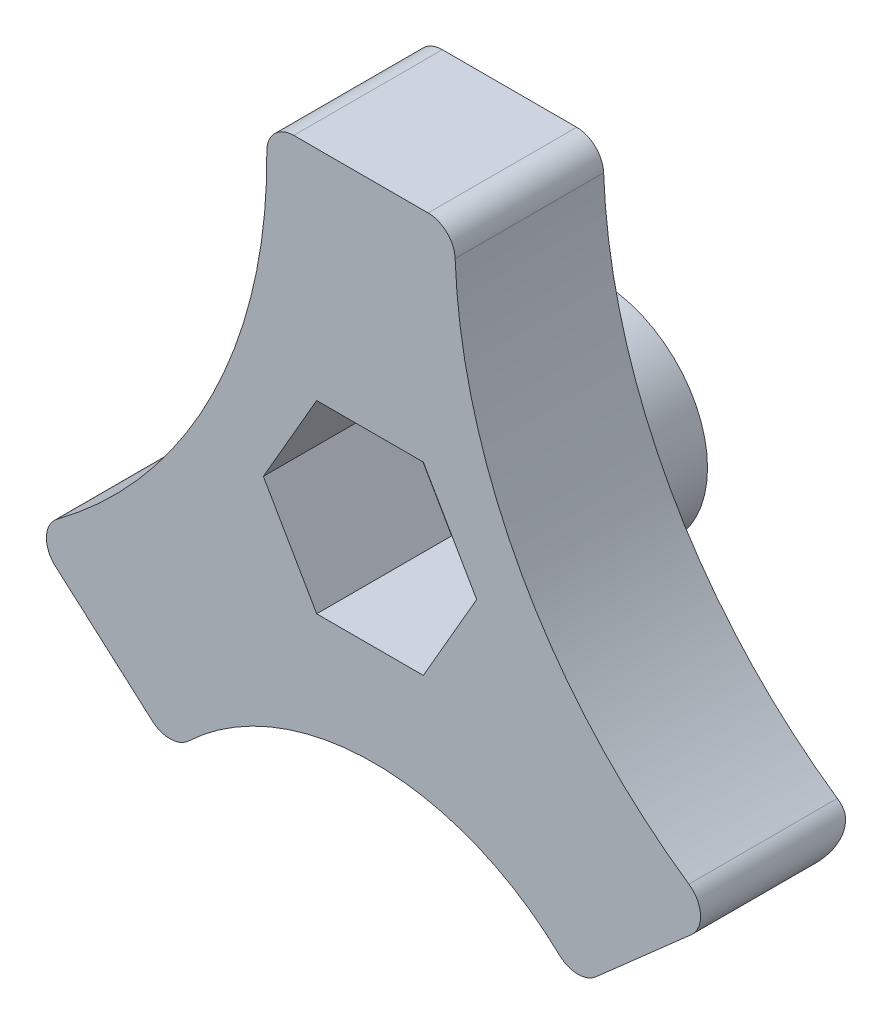
ISO-10303-21;
HEADER;
FILE_DESCRIPTION(('STEP AP214'),'2;1');
FILE_NAME('part.step','',(''),(''),'','','');
FILE_SCHEMA(('AUTOMOTIVE_DESIGN { 1 0 10303 214 1 1 1 1 }'));
ENDSEC;
DATA;
#1=APPLICATION_CONTEXT('core data for automotive mechanical design processes');
#2=APPLICATION_PROTOCOL_DEFINITION('international standard','automotive_design',2000,#1);
#3=PRODUCT_CONTEXT('',#1,'mechanical');
#4=PRODUCT('Part','Part','',(#3));
#5=PRODUCT_RELATED_PRODUCT_CATEGORY('part','',(#4));
#6=PRODUCT_DEFINITION_FORMATION('','',#4);
#7=PRODUCT_DEFINITION_CONTEXT('part definition',#1,'design');
#8=PRODUCT_DEFINITION('design','',#6,#7);
#9=PRODUCT_DEFINITION_SHAPE('','',#8);
#10=(LENGTH_UNIT() NAMED_UNIT(*) SI_UNIT(.MILLI.,.METRE.));
#11=(NAMED_UNIT(*) PLANE_ANGLE_UNIT() SI_UNIT($,.RADIAN.));
#12=(NAMED_UNIT(*) SI_UNIT($,.STERADIAN.) SOLID_ANGLE_UNIT());
#13=UNCERTAINTY_MEASURE_WITH_UNIT(LENGTH_MEASURE(1.E-05),#10,'distance_accuracy_value','');
#14=(GEOMETRIC_REPRESENTATION_CONTEXT(3) GLOBAL_UNCERTAINTY_ASSIGNED_CONTEXT((#13)) GLOBAL_UNIT_ASSIGNED_CONTEXT((#10,
#11,#12)) REPRESENTATION_CONTEXT('',''));
#15=CARTESIAN_POINT('',(0.,0.,0.));
#16=DIRECTION('',(0.,0.,1.));
#17=DIRECTION('',(1.,0.,0.));
#18=AXIS2_PLACEMENT_3D('',#15,#16,#17);
#19=CARTESIAN_POINT('',(-23.0823554861625,17.4065795825905,5.5));
#20=DIRECTION('',(0.,0.,-1.));
#21=DIRECTION('',(-1.,0.,0.));
#22=AXIS2_PLACEMENT_3D('',#19,#20,#21);
#23=CYLINDRICAL_SURFACE('',#22,19.2618771068629);
#24=CARTESIAN_POINT('',(-23.0823554861625,17.4065795825905,0.));
#25=DIRECTION('',(0.,0.,-1.));
#26=DIRECTION('',(-1.,0.,0.));
#27=AXIS2_PLACEMENT_3D('',#24,#25,#26);
#28=CIRCLE('',#27,19.2618771068629);
#29=CARTESIAN_POINT('',(-3.82177900117411,17.6304169025429,0.));
#30=VERTEX_POINT('',#29);
#31=CARTESIAN_POINT('',(-11.5817502216413,1.95484866888513,0.));
#32=VERTEX_POINT('',#31);
#33=EDGE_CURVE('E299',#30,#32,#28,.T.);
#34=ORIENTED_EDGE('',*,*,#33,.T.);
#35=DIRECTION('',(0.,0.,-1.));
#36=VECTOR('',#35,1.);
#37=CARTESIAN_POINT('',(-11.5817502216413,1.95484866888513,5.5));
#38=LINE('',#37,#36);
#39=CARTESIAN_POINT('',(-11.5817502216413,1.95484866888513,5.5));
#40=VERTEX_POINT('',#39);
#41=EDGE_CURVE('E423',#32,#40,#38,.F.);
#42=ORIENTED_EDGE('',*,*,#41,.T.);
#43=CARTESIAN_POINT('',(-23.0823554861625,17.4065795825905,5.5));
#44=DIRECTION('',(0.,0.,-1.));
#45=DIRECTION('',(-1.,0.,0.));
#46=AXIS2_PLACEMENT_3D('',#43,#44,#45);
#47=CIRCLE('',#46,19.2618771068629);
#48=CARTESIAN_POINT('',(-3.82177900117411,17.6304169025429,5.5));
#49=VERTEX_POINT('',#48);
#50=EDGE_CURVE('E273',#49,#40,#47,.T.);
#51=ORIENTED_EDGE('',*,*,#50,.F.);
#52=DIRECTION('',(0.,0.,-1.));
#53=VECTOR('',#52,1.);
#54=CARTESIAN_POINT('',(-3.82177900117411,17.6304169025429,5.5));
#55=LINE('',#54,#53);
#56=EDGE_CURVE('E419',#49,#30,#55,.T.);
#57=ORIENTED_EDGE('',*,*,#56,.T.);
#58=EDGE_LOOP('',(#34,#42,#51,#57));
#59=FACE_BOUND('',#58,.T.);
#60=ADVANCED_FACE('F54',(#59),#23,.F.);
#61=CARTESIAN_POINT('',(-7.35186308797902,-3.38452443490138,5.5));
#62=DIRECTION('',(0.661437827766148,0.75,0.));
#63=DIRECTION('',(-0.75,0.661437827766148,0.));
#64=AXIS2_PLACEMENT_3D('',#61,#62,#63);
#65=PLANE('',#64);
#66=DIRECTION('',(0.75,-0.661437827766148,0.));
#67=VECTOR('',#66,1.);
#68=CARTESIAN_POINT('',(-7.35186308797902,-3.38452443490138,5.5));
#69=LINE('',#68,#67);
#70=CARTESIAN_POINT('',(-11.6461223947614,0.402656295422211,5.5));
#71=VERTEX_POINT('',#70);
#72=CARTESIAN_POINT('',(-8.06770145055651,-2.75321433946814,5.5));
#73=VERTEX_POINT('',#72);
#74=EDGE_CURVE('E277',#71,#73,#69,.T.);
#75=ORIENTED_EDGE('',*,*,#74,.F.);
#76=DIRECTION('',(0.,0.,-1.));
#77=VECTOR('',#76,1.);
#78=CARTESIAN_POINT('',(-11.6461223947614,0.402656295422212,5.5));
#79=LINE('',#78,#77);
#80=CARTESIAN_POINT('',(-11.6461223947614,0.402656295422211,0.));
#81=VERTEX_POINT('',#80);
#82=EDGE_CURVE('E415',#71,#81,#79,.T.);
#83=ORIENTED_EDGE('',*,*,#82,.T.);
#84=DIRECTION('',(0.75,-0.661437827766148,0.));
#85=VECTOR('',#84,1.);
#86=CARTESIAN_POINT('',(-7.35186308797902,-3.38452443490138,0.));
#87=LINE('',#86,#85);
#88=CARTESIAN_POINT('',(-8.06770145055651,-2.75321433946814,0.));
#89=VERTEX_POINT('',#88);
#90=EDGE_CURVE('E303',#81,#89,#87,.T.);
#91=ORIENTED_EDGE('',*,*,#90,.T.);
#92=DIRECTION('',(0.,0.,-1.));
#93=VECTOR('',#92,1.);
#94=CARTESIAN_POINT('',(-8.06770145055651,-2.75321433946814,5.5));
#95=LINE('',#94,#93);
#96=EDGE_CURVE('E412',#89,#73,#95,.F.);
#97=ORIENTED_EDGE('',*,*,#96,.T.);
#98=EDGE_LOOP('',(#75,#83,#91,#97));
#99=FACE_BOUND('',#98,.T.);
#100=ADVANCED_FACE('F352',(#99),#65,.F.);
#101=CARTESIAN_POINT('',(0.148136912020978,-9.99890271256286,5.5));
#102=DIRECTION('',(0.,0.,-1.));
#103=DIRECTION('',(-1.,0.,0.));
#104=AXIS2_PLACEMENT_3D('',#101,#102,#103);
#105=CYLINDRICAL_SURFACE('',#104,10.);
#106=CARTESIAN_POINT('',(6.94910486255448,-2.66767942201877,0.));
#107=CARTESIAN_POINT('',(6.96028668902214,-2.67805268072477,4.29945869083581E-08));
#108=CARTESIAN_POINT('',(6.97143334386389,-2.68844061663108,0.000345131536552185));
#109=CARTESIAN_POINT('',(6.99365631029555,-2.70924584284435,0.00172539971523947));
#110=CARTESIAN_POINT('',(7.00473262188547,-2.7196631331513,0.00276057935196146));
#111=CARTESIAN_POINT('',(7.01577376184947,-2.73009510065857,0.00414080453606182));
#112=B_SPLINE_CURVE_WITH_KNOTS('',3,(#106,#107,#108,#109,#110,#111),.UNSPECIFIED.,.F.,.F.,(4,2,
4),(0.,0.0457218319176844,0.0914436638353682),.UNSPECIFIED.);
#113=CARTESIAN_POINT('',(6.94910486255448,-2.66767942201877,0.));
#114=VERTEX_POINT('',#113);
#115=CARTESIAN_POINT('',(7.01577376184947,-2.73009510065857,0.0041408045360616));
#116=VERTEX_POINT('',#115);
#117=EDGE_CURVE('E331',#114,#116,#112,.T.);
#118=ORIENTED_EDGE('',*,*,#117,.T.);
#119=DIRECTION('',(0.,0.,-1.));
#120=VECTOR('',#119,1.);
#121=CARTESIAN_POINT('',(7.01577376184947,-2.73009510065857,5.5));
#122=LINE('',#121,#120);
#123=CARTESIAN_POINT('',(7.01577376184947,-2.73009510065857,5.5));
#124=VERTEX_POINT('',#123);
#125=EDGE_CURVE('E340',#116,#124,#122,.F.);
#126=ORIENTED_EDGE('',*,*,#125,.T.);
#127=CARTESIAN_POINT('',(0.148136912020978,-9.99890271256286,5.5));
#128=DIRECTION('',(0.,0.,-1.));
#129=DIRECTION('',(-1.,0.,0.));
#130=AXIS2_PLACEMENT_3D('',#127,#128,#129);
#131=CIRCLE('',#130,10.);
#132=CARTESIAN_POINT('',(-6.71949993780752,-2.73009510065857,5.5));
#133=VERTEX_POINT('',#132);
#134=EDGE_CURVE('E282',#133,#124,#131,.T.);
#135=ORIENTED_EDGE('',*,*,#134,.F.);
#136=DIRECTION('',(0.,0.,-1.));
#137=VECTOR('',#136,1.);
#138=CARTESIAN_POINT('',(-6.71949993780752,-2.73009510065857,5.5));
#139=LINE('',#138,#137);
#140=CARTESIAN_POINT('',(-6.71949993780752,-2.73009510065857,0.));
#141=VERTEX_POINT('',#140);
#142=EDGE_CURVE('E327',#133,#141,#139,.T.);
#143=ORIENTED_EDGE('',*,*,#142,.T.);
#144=CARTESIAN_POINT('',(0.148136912020978,-9.99890271256286,0.));
#145=DIRECTION('',(0.,0.,-1.));
#146=DIRECTION('',(-1.,0.,0.));
#147=AXIS2_PLACEMENT_3D('',#144,#145,#146);
#148=CIRCLE('',#147,10.);
#149=EDGE_CURVE('E307',#141,#114,#148,.T.);
#150=ORIENTED_EDGE('',*,*,#149,.T.);
#151=EDGE_LOOP('',(#118,#126,#135,#143,#150));
#152=FACE_BOUND('',#151,.T.);
#153=ADVANCED_FACE('F346',(#152),#105,.F.);
#154=CARTESIAN_POINT('',(7.64813691202098,-3.38452443490138,5.5));
#155=DIRECTION('',(-0.661437827766148,0.75,0.));
#156=DIRECTION('',(-0.75,-0.661437827766148,0.));
#157=AXIS2_PLACEMENT_3D('',#154,#155,#156);
#158=PLANE('',#157);
#159=DIRECTION('',(0.75,0.661437827766148,0.));
#160=VECTOR('',#159,1.);
#161=CARTESIAN_POINT('',(7.64813691202098,-3.38452443490138,5.5));
#162=LINE('',#161,#160);
#163=CARTESIAN_POINT('',(8.36397527459847,-2.75321433946814,5.5));
#164=VERTEX_POINT('',#163);
#165=CARTESIAN_POINT('',(11.9043647759122,0.369115715458534,5.5));
#166=VERTEX_POINT('',#165);
#167=EDGE_CURVE('E286',#164,#166,#162,.T.);
#168=ORIENTED_EDGE('',*,*,#167,.F.);
#169=DIRECTION('',(0.,0.,-1.));
#170=VECTOR('',#169,1.);
#171=CARTESIAN_POINT('',(8.36397527459847,-2.75321433946814,5.5));
#172=LINE('',#171,#170);
#173=CARTESIAN_POINT('',(8.36397527459847,-2.75321433946814,1.));
#174=VERTEX_POINT('',#173);
#175=EDGE_CURVE('E323',#164,#174,#172,.T.);
#176=ORIENTED_EDGE('',*,*,#175,.T.);
#177=DIRECTION('',(0.75,0.661437827766148,0.));
#178=VECTOR('',#177,1.);
#179=CARTESIAN_POINT('',(12.898136912021,1.24554035946165,1.));
#180=LINE('',#179,#178);
#181=CARTESIAN_POINT('',(11.9043647759122,0.369115715458534,1.));
#182=VERTEX_POINT('',#181);
#183=EDGE_CURVE('E320',#174,#182,#180,.T.);
#184=ORIENTED_EDGE('',*,*,#183,.T.);
#185=DIRECTION('',(0.,0.,-1.));
#186=VECTOR('',#185,1.);
#187=CARTESIAN_POINT('',(11.9043647759122,0.369115715458535,5.5));
#188=LINE('',#187,#186);
#189=EDGE_CURVE('E298',#182,#166,#188,.F.);
#190=ORIENTED_EDGE('',*,*,#189,.T.);
#191=EDGE_LOOP('',(#168,#176,#184,#190));
#192=FACE_BOUND('',#191,.T.);
#193=ADVANCED_FACE('F351',(#192),#158,.F.);
#194=CARTESIAN_POINT('',(23.1386811231597,18.4249249310845,5.5));
#195=DIRECTION('',(0.,0.,-1.));
#196=DIRECTION('',(-1.,0.,0.));
#197=AXIS2_PLACEMENT_3D('',#194,#195,#196);
#198=CYLINDRICAL_SURFACE('',#197,20.);
#199=CARTESIAN_POINT('',(23.1386811231597,18.4249249310845,5.5));
#200=DIRECTION('',(0.,0.,-1.));
#201=DIRECTION('',(1.,0.,0.));
#202=AXIS2_PLACEMENT_3D('',#199,#200,#201);
#203=CIRCLE('',#202,20.);
#204=CARTESIAN_POINT('',(11.8093914326705,1.94320186858358,5.5));
#205=VERTEX_POINT('',#204);
#206=CARTESIAN_POINT('',(3.15258419822641,17.6793179922952,5.5));
#207=VERTEX_POINT('',#206);
#208=EDGE_CURVE('E290',#205,#207,#203,.T.);
#209=ORIENTED_EDGE('',*,*,#208,.F.);
#210=DIRECTION('',(0.,0.,-1.));
#211=VECTOR('',#210,1.);
#212=CARTESIAN_POINT('',(11.8093914326705,1.94320186858358,5.5));
#213=LINE('',#212,#211);
#214=CARTESIAN_POINT('',(11.8093914326705,1.94320186858358,0.));
#215=VERTEX_POINT('',#214);
#216=EDGE_CURVE('E409',#205,#215,#213,.T.);
#217=ORIENTED_EDGE('',*,*,#216,.T.);
#218=CARTESIAN_POINT('',(23.1386811231597,18.4249249310845,0.));
#219=DIRECTION('',(0.,0.,-1.));
#220=DIRECTION('',(1.,0.,0.));
#221=AXIS2_PLACEMENT_3D('',#218,#219,#220);
#222=CIRCLE('',#221,20.);
#223=CARTESIAN_POINT('',(3.15258419822641,17.6793179922952,0.));
#224=VERTEX_POINT('',#223);
#225=EDGE_CURVE('E311',#215,#224,#222,.T.);
#226=ORIENTED_EDGE('',*,*,#225,.T.);
#227=DIRECTION('',(0.,0.,-1.));
#228=VECTOR('',#227,1.);
#229=CARTESIAN_POINT('',(3.15258419822641,17.6793179922952,5.5));
#230=LINE('',#229,#228);
#231=EDGE_CURVE('E406',#224,#207,#230,.F.);
#232=ORIENTED_EDGE('',*,*,#231,.T.);
#233=EDGE_LOOP('',(#209,#217,#226,#232));
#234=FACE_BOUND('',#233,.T.);
#235=ADVANCED_FACE('F445',(#234),#198,.F.);
#236=CARTESIAN_POINT('',(-3.86014039385226,18.6420376453558,5.5));
#237=DIRECTION('',(0.,-1.,0.));
#238=DIRECTION('',(0.,0.,-1.));
#239=AXIS2_PLACEMENT_3D('',#236,#237,#238);
#240=PLANE('',#239);
#241=DIRECTION('',(-1.,0.,0.));
#242=VECTOR('',#241,1.);
#243=CARTESIAN_POINT('',(-3.86014039385226,18.6420376453558,0.));
#244=LINE('',#243,#242);
#245=CARTESIAN_POINT('',(2.15327935197974,18.6420376453558,0.));
#246=VERTEX_POINT('',#245);
#247=CARTESIAN_POINT('',(-2.82184652428556,18.6420376453558,0.));
#248=VERTEX_POINT('',#247);
#249=EDGE_CURVE('E278',#246,#248,#244,.T.);
#250=ORIENTED_EDGE('',*,*,#249,.T.);
#251=DIRECTION('',(0.,0.,-1.));
#252=VECTOR('',#251,1.);
#253=CARTESIAN_POINT('',(-2.82184652428556,18.6420376453558,5.5));
#254=LINE('',#253,#252);
#255=CARTESIAN_POINT('',(-2.82184652428556,18.6420376453558,5.5));
#256=VERTEX_POINT('',#255);
#257=EDGE_CURVE('E13',#248,#256,#254,.F.);
#258=ORIENTED_EDGE('',*,*,#257,.T.);
#259=DIRECTION('',(-1.,0.,0.));
#260=VECTOR('',#259,1.);
#261=CARTESIAN_POINT('',(-3.86014039385226,18.6420376453558,5.5));
#262=LINE('',#261,#260);
#263=CARTESIAN_POINT('',(2.15327935197974,18.6420376453558,5.5));
#264=VERTEX_POINT('',#263);
#265=EDGE_CURVE('E294',#264,#256,#262,.T.);
#266=ORIENTED_EDGE('',*,*,#265,.F.);
#267=DIRECTION('',(0.,0.,-1.));
#268=VECTOR('',#267,1.);
#269=CARTESIAN_POINT('',(2.15327935197974,18.6420376453558,5.5));
#270=LINE('',#269,#268);
#271=EDGE_CURVE('E64',#264,#246,#270,.T.);
#272=ORIENTED_EDGE('',*,*,#271,.T.);
#273=EDGE_LOOP('',(#250,#258,#266,#272));
#274=FACE_BOUND('',#273,.T.);
#275=ADVANCED_FACE('F479',(#274),#240,.F.);
#276=CARTESIAN_POINT('',(-23.0823554861625,17.4065795825905,5.5));
#277=DIRECTION('',(0.,0.,-1.));
#278=DIRECTION('',(-1.,0.,0.));
#279=AXIS2_PLACEMENT_3D('',#276,#277,#278);
#280=PLANE('',#279);
#281=DIRECTION('',(0.5,-0.866025403784439,0.));
#282=VECTOR('',#281,1.);
#283=CARTESIAN_POINT('',(-3.95,7.14203764535577,5.5));
#284=LINE('',#283,#282);
#285=CARTESIAN_POINT('',(-3.95000000000001,7.14203764535577,5.5));
#286=VERTEX_POINT('',#285);
#287=CARTESIAN_POINT('',(-1.975,3.72123730040724,5.5));
#288=VERTEX_POINT('',#287);
#289=EDGE_CURVE('E236',#286,#288,#284,.T.);
#290=ORIENTED_EDGE('',*,*,#289,.F.);
#291=DIRECTION('',(-0.50000000000001,-0.866025403784433,0.));
#292=VECTOR('',#291,1.);
#293=CARTESIAN_POINT('',(-1.97499999999992,10.5628379903044,5.5));
#294=LINE('',#293,#292);
#295=CARTESIAN_POINT('',(-1.97499999999992,10.5628379903044,5.5));
#296=VERTEX_POINT('',#295);
#297=EDGE_CURVE('E72',#296,#286,#294,.T.);
#298=ORIENTED_EDGE('',*,*,#297,.F.);
#299=DIRECTION('',(-1.,0.,0.));
#300=VECTOR('',#299,1.);
#301=CARTESIAN_POINT('',(1.97500000000008,10.5628379903043,5.5));
#302=LINE('',#301,#300);
#303=CARTESIAN_POINT('',(1.97500000000008,10.5628379903043,5.5));
#304=VERTEX_POINT('',#303);
#305=EDGE_CURVE('E212',#304,#296,#302,.T.);
#306=ORIENTED_EDGE('',*,*,#305,.F.);
#307=DIRECTION('',(-0.49999999999999,0.866025403784444,0.));
#308=VECTOR('',#307,1.);
#309=CARTESIAN_POINT('',(3.95,7.14203764535578,5.5));
#310=LINE('',#309,#308);
#311=CARTESIAN_POINT('',(3.95,7.14203764535578,5.5));
#312=VERTEX_POINT('',#311);
#313=EDGE_CURVE('E217',#312,#304,#310,.T.);
#314=ORIENTED_EDGE('',*,*,#313,.F.);
#315=DIRECTION('',(0.5,0.866025403784439,0.));
#316=VECTOR('',#315,1.);
#317=CARTESIAN_POINT('',(1.975,3.72123730040724,5.5));
#318=LINE('',#317,#316);
#319=CARTESIAN_POINT('',(1.975,3.72123730040724,5.5));
#320=VERTEX_POINT('',#319);
#321=EDGE_CURVE('E243',#320,#312,#318,.T.);
#322=ORIENTED_EDGE('',*,*,#321,.F.);
#323=DIRECTION('',(1.,0.,0.));
#324=VECTOR('',#323,1.);
#325=CARTESIAN_POINT('',(-1.975,3.72123730040724,5.5));
#326=LINE('',#325,#324);
#327=EDGE_CURVE('E239',#288,#320,#326,.T.);
#328=ORIENTED_EDGE('',*,*,#327,.F.);
#329=EDGE_LOOP('',(#290,#298,#306,#314,#322,#328));
#330=FACE_BOUND('',#329,.T.);
#331=ORIENTED_EDGE('',*,*,#134,.T.);
#332=CARTESIAN_POINT('',(7.70253744683232,-2.00321433946814,5.5));
#333=DIRECTION('',(0.,0.,-1.));
#334=DIRECTION('',(-1.,0.,0.));
#335=AXIS2_PLACEMENT_3D('',#332,#333,#334);
#336=CIRCLE('',#335,1.);
#337=EDGE_CURVE('E376',#124,#164,#336,.F.);
#338=ORIENTED_EDGE('',*,*,#337,.T.);
#339=ORIENTED_EDGE('',*,*,#167,.T.);
#340=CARTESIAN_POINT('',(11.242926948146,1.11911571545853,5.5));
#341=DIRECTION('',(0.,0.,-1.));
#342=DIRECTION('',(-1.,0.,0.));
#343=AXIS2_PLACEMENT_3D('',#340,#341,#342);
#344=CIRCLE('',#343,1.);
#345=EDGE_CURVE('E382',#166,#205,#344,.F.);
#346=ORIENTED_EDGE('',*,*,#345,.T.);
#347=ORIENTED_EDGE('',*,*,#208,.T.);
#348=CARTESIAN_POINT('',(2.15327935197974,17.6420376453558,5.5));
#349=DIRECTION('',(0.,0.,-1.));
#350=DIRECTION('',(-1.,0.,0.));
#351=AXIS2_PLACEMENT_3D('',#348,#349,#350);
#352=CIRCLE('',#351,1.);
#353=EDGE_CURVE('E449',#207,#264,#352,.F.);
#354=ORIENTED_EDGE('',*,*,#353,.T.);
#355=ORIENTED_EDGE('',*,*,#265,.T.);
#356=CARTESIAN_POINT('',(-2.82184652428556,17.6420376453558,5.5));
#357=DIRECTION('',(0.,0.,-1.));
#358=DIRECTION('',(-1.,0.,0.));
#359=AXIS2_PLACEMENT_3D('',#356,#357,#358);
#360=CIRCLE('',#359,1.);
#361=EDGE_CURVE('E452',#256,#49,#360,.F.);
#362=ORIENTED_EDGE('',*,*,#361,.T.);
#363=ORIENTED_EDGE('',*,*,#50,.T.);
#364=CARTESIAN_POINT('',(-10.9846845669952,1.15265629542221,5.5));
#365=DIRECTION('',(0.,0.,-1.));
#366=DIRECTION('',(-1.,0.,0.));
#367=AXIS2_PLACEMENT_3D('',#364,#365,#366);
#368=CIRCLE('',#367,1.);
#369=EDGE_CURVE('E389',#40,#71,#368,.F.);
#370=ORIENTED_EDGE('',*,*,#369,.T.);
#371=ORIENTED_EDGE('',*,*,#74,.T.);
#372=CARTESIAN_POINT('',(-7.40626362279037,-2.00321433946814,5.5));
#373=DIRECTION('',(0.,0.,-1.));
#374=DIRECTION('',(-1.,0.,0.));
#375=AXIS2_PLACEMENT_3D('',#372,#373,#374);
#376=CIRCLE('',#375,1.);
#377=EDGE_CURVE('E456',#73,#133,#376,.F.);
#378=ORIENTED_EDGE('',*,*,#377,.T.);
#379=EDGE_LOOP('',(#331,#338,#339,#346,#347,#354,#355,#362,#363,#370,#371,#378));
#380=FACE_BOUND('',#379,.T.);
#381=ADVANCED_FACE('F441',(#330,#380),#280,.F.);
#382=CARTESIAN_POINT('',(-23.0823554861625,17.4065795825905,0.));
#383=DIRECTION('',(0.,0.,-1.));
#384=DIRECTION('',(-1.,0.,0.));
#385=AXIS2_PLACEMENT_3D('',#382,#383,#384);
#386=PLANE('',#385);
#387=CARTESIAN_POINT('',(0.,7.14203764535578,0.));
#388=DIRECTION('',(0.,0.,-1.));
#389=DIRECTION('',(-1.,0.,0.));
#390=AXIS2_PLACEMENT_3D('',#387,#388,#389);
#391=CIRCLE('',#390,4.);
#392=CARTESIAN_POINT('',(-4.,7.14203764535578,0.));
#393=VERTEX_POINT('',#392);
#394=EDGE_CURVE('E253',#393,#393,#391,.T.);
#395=ORIENTED_EDGE('',*,*,#394,.F.);
#396=EDGE_LOOP('',(#395));
#397=FACE_BOUND('',#396,.T.);
#398=CARTESIAN_POINT('',(11.242926948146,1.11911571545853,0.));
#399=DIRECTION('',(0.,0.,-1.));
#400=DIRECTION('',(-1.,0.,0.));
#401=AXIS2_PLACEMENT_3D('',#398,#399,#400);
#402=CIRCLE('',#401,1.);
#403=CARTESIAN_POINT('',(11.992926948146,1.78055354322468,0.));
#404=VERTEX_POINT('',#403);
#405=EDGE_CURVE('E80',#215,#404,#402,.T.);
#406=ORIENTED_EDGE('',*,*,#405,.T.);
#407=DIRECTION('',(0.75,0.661437827766148,0.));
#408=VECTOR('',#407,1.);
#409=CARTESIAN_POINT('',(6.98669908425483,-2.63452443490138,0.));
#410=LINE('',#409,#408);
#411=EDGE_CURVE('E403',#404,#114,#410,.F.);
#412=ORIENTED_EDGE('',*,*,#411,.T.);
#413=ORIENTED_EDGE('',*,*,#149,.F.);
#414=CARTESIAN_POINT('',(-7.40626362279037,-2.00321433946814,0.));
#415=DIRECTION('',(0.,0.,-1.));
#416=DIRECTION('',(-1.,0.,0.));
#417=AXIS2_PLACEMENT_3D('',#414,#415,#416);
#418=CIRCLE('',#417,1.);
#419=EDGE_CURVE('E395',#141,#89,#418,.T.);
#420=ORIENTED_EDGE('',*,*,#419,.T.);
#421=ORIENTED_EDGE('',*,*,#90,.F.);
#422=CARTESIAN_POINT('',(-10.9846845669952,1.15265629542221,0.));
#423=DIRECTION('',(0.,0.,-1.));
#424=DIRECTION('',(-1.,0.,0.));
#425=AXIS2_PLACEMENT_3D('',#422,#423,#424);
#426=CIRCLE('',#425,1.);
#427=EDGE_CURVE('E398',#81,#32,#426,.T.);
#428=ORIENTED_EDGE('',*,*,#427,.T.);
#429=ORIENTED_EDGE('',*,*,#33,.F.);
#430=CARTESIAN_POINT('',(-2.82184652428556,17.6420376453558,0.));
#431=DIRECTION('',(0.,0.,-1.));
#432=DIRECTION('',(-1.,0.,0.));
#433=AXIS2_PLACEMENT_3D('',#430,#431,#432);
#434=CIRCLE('',#433,1.);
#435=EDGE_CURVE('E387',#30,#248,#434,.T.);
#436=ORIENTED_EDGE('',*,*,#435,.T.);
#437=ORIENTED_EDGE('',*,*,#249,.F.);
#438=CARTESIAN_POINT('',(2.15327935197974,17.6420376453558,0.));
#439=DIRECTION('',(0.,0.,-1.));
#440=DIRECTION('',(-1.,0.,0.));
#441=AXIS2_PLACEMENT_3D('',#438,#439,#440);
#442=CIRCLE('',#441,1.);
#443=EDGE_CURVE('E381',#246,#224,#442,.T.);
#444=ORIENTED_EDGE('',*,*,#443,.T.);
#445=ORIENTED_EDGE('',*,*,#225,.F.);
#446=EDGE_LOOP('',(#406,#412,#413,#420,#421,#428,#429,#436,#437,#444,#445));
#447=FACE_BOUND('',#446,.T.);
#448=ADVANCED_FACE('F471',(#397,#447),#386,.T.);
#449=CARTESIAN_POINT('',(11.242926948146,1.11911571545853,5.5));
#450=DIRECTION('',(0.,0.,-1.));
#451=DIRECTION('',(-1.,0.,0.));
#452=AXIS2_PLACEMENT_3D('',#449,#450,#451);
#453=CYLINDRICAL_SURFACE('',#452,1.);
#454=ORIENTED_EDGE('',*,*,#345,.F.);
#455=ORIENTED_EDGE('',*,*,#189,.F.);
#456=CARTESIAN_POINT('',(11.242926948146,1.11911571545853,1.));
#457=DIRECTION('',(-0.530330085889911,-0.467707173346743,-0.707106781186547));
#458=DIRECTION('',(0.530330085889911,0.467707173346743,-0.707106781186547));
#459=AXIS2_PLACEMENT_3D('',#456,#457,#458);
#460=ELLIPSE('',#459,1.41421356237309,1.);
#461=EDGE_CURVE('E58',#404,#182,#460,.T.);
#462=ORIENTED_EDGE('',*,*,#461,.F.);
#463=ORIENTED_EDGE('',*,*,#405,.F.);
#464=ORIENTED_EDGE('',*,*,#216,.F.);
#465=EDGE_LOOP('',(#454,#455,#462,#463,#464));
#466=FACE_BOUND('',#465,.T.);
#467=ADVANCED_FACE('F371',(#466),#453,.T.);
#468=CARTESIAN_POINT('',(6.98669908425483,-2.63452443490138,1.));
#469=DIRECTION('',(-0.75,-0.661437827766148,0.));
#470=DIRECTION('',(0.661437827766148,-0.75,0.));
#471=AXIS2_PLACEMENT_3D('',#468,#469,#470);
#472=CYLINDRICAL_SURFACE('',#471,1.);
#473=ORIENTED_EDGE('',*,*,#461,.T.);
#474=ORIENTED_EDGE('',*,*,#183,.F.);
#475=CARTESIAN_POINT('',(7.70253744683232,-2.00321433946814,1.));
#476=DIRECTION('',(-0.530330085889911,-0.467707173346743,0.707106781186547));
#477=DIRECTION('',(-0.530330085889911,-0.467707173346743,-0.707106781186547));
#478=AXIS2_PLACEMENT_3D('',#475,#476,#477);
#479=ELLIPSE('',#478,1.41421356237309,1.);
#480=EDGE_CURVE('E269',#116,#174,#479,.T.);
#481=ORIENTED_EDGE('',*,*,#480,.F.);
#482=ORIENTED_EDGE('',*,*,#117,.F.);
#483=ORIENTED_EDGE('',*,*,#411,.F.);
#484=EDGE_LOOP('',(#473,#474,#481,#482,#483));
#485=FACE_BOUND('',#484,.T.);
#486=ADVANCED_FACE('F342',(#485),#472,.T.);
#487=CARTESIAN_POINT('',(7.70253744683232,-2.00321433946814,5.5));
#488=DIRECTION('',(0.,0.,-1.));
#489=DIRECTION('',(-1.,0.,0.));
#490=AXIS2_PLACEMENT_3D('',#487,#488,#489);
#491=CYLINDRICAL_SURFACE('',#490,1.);
#492=ORIENTED_EDGE('',*,*,#337,.F.);
#493=ORIENTED_EDGE('',*,*,#125,.F.);
#494=ORIENTED_EDGE('',*,*,#480,.T.);
#495=ORIENTED_EDGE('',*,*,#175,.F.);
#496=EDGE_LOOP('',(#492,#493,#494,#495));
#497=FACE_BOUND('',#496,.T.);
#498=ADVANCED_FACE('F360',(#497),#491,.T.);
#499=CARTESIAN_POINT('',(-10.9846845669952,1.15265629542221,5.5));
#500=DIRECTION('',(0.,0.,-1.));
#501=DIRECTION('',(-1.,0.,0.));
#502=AXIS2_PLACEMENT_3D('',#499,#500,#501);
#503=CYLINDRICAL_SURFACE('',#502,1.);
#504=ORIENTED_EDGE('',*,*,#369,.F.);
#505=ORIENTED_EDGE('',*,*,#41,.F.);
#506=ORIENTED_EDGE('',*,*,#427,.F.);
#507=ORIENTED_EDGE('',*,*,#82,.F.);
#508=EDGE_LOOP('',(#504,#505,#506,#507));
#509=FACE_BOUND('',#508,.T.);
#510=ADVANCED_FACE('F362',(#509),#503,.T.);
#511=CARTESIAN_POINT('',(-7.40626362279037,-2.00321433946814,5.5));
#512=DIRECTION('',(0.,0.,-1.));
#513=DIRECTION('',(-1.,0.,0.));
#514=AXIS2_PLACEMENT_3D('',#511,#512,#513);
#515=CYLINDRICAL_SURFACE('',#514,1.);
#516=ORIENTED_EDGE('',*,*,#377,.F.);
#517=ORIENTED_EDGE('',*,*,#96,.F.);
#518=ORIENTED_EDGE('',*,*,#419,.F.);
#519=ORIENTED_EDGE('',*,*,#142,.F.);
#520=EDGE_LOOP('',(#516,#517,#518,#519));
#521=FACE_BOUND('',#520,.T.);
#522=ADVANCED_FACE('F368',(#521),#515,.T.);
#523=CARTESIAN_POINT('',(-2.82184652428556,17.6420376453558,5.5));
#524=DIRECTION('',(0.,0.,-1.));
#525=DIRECTION('',(-1.,0.,0.));
#526=AXIS2_PLACEMENT_3D('',#523,#524,#525);
#527=CYLINDRICAL_SURFACE('',#526,1.);
#528=ORIENTED_EDGE('',*,*,#361,.F.);
#529=ORIENTED_EDGE('',*,*,#257,.F.);
#530=ORIENTED_EDGE('',*,*,#435,.F.);
#531=ORIENTED_EDGE('',*,*,#56,.F.);
#532=EDGE_LOOP('',(#528,#529,#530,#531));
#533=FACE_BOUND('',#532,.T.);
#534=ADVANCED_FACE('F475',(#533),#527,.T.);
#535=CARTESIAN_POINT('',(2.15327935197974,17.6420376453558,5.5));
#536=DIRECTION('',(0.,0.,-1.));
#537=DIRECTION('',(-1.,0.,0.));
#538=AXIS2_PLACEMENT_3D('',#535,#536,#537);
#539=CYLINDRICAL_SURFACE('',#538,1.);
#540=ORIENTED_EDGE('',*,*,#353,.F.);
#541=ORIENTED_EDGE('',*,*,#231,.F.);
#542=ORIENTED_EDGE('',*,*,#443,.F.);
#543=ORIENTED_EDGE('',*,*,#271,.F.);
#544=EDGE_LOOP('',(#540,#541,#542,#543));
#545=FACE_BOUND('',#544,.T.);
#546=ADVANCED_FACE('F56',(#545),#539,.T.);
#547=CARTESIAN_POINT('',(0.,7.14203764535578,-3.));
#548=DIRECTION('',(0.,0.,1.));
#549=DIRECTION('',(1.,0.,0.));
#550=AXIS2_PLACEMENT_3D('',#547,#548,#549);
#551=CYLINDRICAL_SURFACE('',#550,4.);
#552=CARTESIAN_POINT('',(0.,7.14203764535578,-3.));
#553=DIRECTION('',(0.,0.,-1.));
#554=DIRECTION('',(-1.,0.,0.));
#555=AXIS2_PLACEMENT_3D('',#552,#553,#554);
#556=CIRCLE('',#555,4.);
#557=CARTESIAN_POINT('',(-4.,7.14203764535578,-3.));
#558=VERTEX_POINT('',#557);
#559=EDGE_CURVE('E265',#558,#558,#556,.T.);
#560=ORIENTED_EDGE('',*,*,#559,.F.);
#561=EDGE_LOOP('',(#560));
#562=FACE_BOUND('',#561,.T.);
#563=ORIENTED_EDGE('',*,*,#394,.T.);
#564=EDGE_LOOP('',(#563));
#565=FACE_BOUND('',#564,.T.);
#566=ADVANCED_FACE('F492',(#562,#565),#551,.T.);
#567=CARTESIAN_POINT('',(0.,7.14203764535578,-3.));
#568=DIRECTION('',(0.,0.,-1.));
#569=DIRECTION('',(-1.,0.,0.));
#570=AXIS2_PLACEMENT_3D('',#567,#568,#569);
#571=PLANE('',#570);
#572=CARTESIAN_POINT('',(0.,7.14203764535578,-3.));
#573=DIRECTION('',(0.,0.,-1.));
#574=DIRECTION('',(-1.,0.,0.));
#575=AXIS2_PLACEMENT_3D('',#572,#573,#574);
#576=CIRCLE('',#575,1.75);
#577=CARTESIAN_POINT('',(-1.75,7.14203764535578,-3.));
#578=VERTEX_POINT('',#577);
#579=EDGE_CURVE('E533',#578,#578,#576,.T.);
#580=ORIENTED_EDGE('',*,*,#579,.F.);
#581=EDGE_LOOP('',(#580));
#582=FACE_BOUND('',#581,.T.);
#583=ORIENTED_EDGE('',*,*,#559,.T.);
#584=EDGE_LOOP('',(#583));
#585=FACE_BOUND('',#584,.T.);
#586=ADVANCED_FACE('F495',(#582,#585),#571,.T.);
#587=CARTESIAN_POINT('',(-1.97499999999992,10.5628379903044,0.5));
#588=DIRECTION('',(-0.866025403784433,0.50000000000001,0.));
#589=DIRECTION('',(-0.50000000000001,-0.866025403784433,0.));
#590=AXIS2_PLACEMENT_3D('',#587,#588,#589);
#591=PLANE('',#590);
#592=ORIENTED_EDGE('',*,*,#297,.T.);
#593=DIRECTION('',(0.,0.,1.));
#594=VECTOR('',#593,1.);
#595=CARTESIAN_POINT('',(-3.95,7.14203764535577,0.5));
#596=LINE('',#595,#594);
#597=CARTESIAN_POINT('',(-3.95,7.14203764535577,0.5));
#598=VERTEX_POINT('',#597);
#599=EDGE_CURVE('E186',#598,#286,#596,.T.);
#600=ORIENTED_EDGE('',*,*,#599,.F.);
#601=DIRECTION('',(-0.50000000000001,-0.866025403784433,0.));
#602=VECTOR('',#601,1.);
#603=CARTESIAN_POINT('',(-1.97499999999992,10.5628379903044,0.5));
#604=LINE('',#603,#602);
#605=CARTESIAN_POINT('',(-1.97499999999992,10.5628379903044,0.5));
#606=VERTEX_POINT('',#605);
#607=EDGE_CURVE('E190',#606,#598,#604,.T.);
#608=ORIENTED_EDGE('',*,*,#607,.F.);
#609=DIRECTION('',(0.,0.,1.));
#610=VECTOR('',#609,1.);
#611=CARTESIAN_POINT('',(-1.97499999999992,10.5628379903044,0.5));
#612=LINE('',#611,#610);
#613=EDGE_CURVE('E250',#606,#296,#612,.T.);
#614=ORIENTED_EDGE('',*,*,#613,.T.);
#615=EDGE_LOOP('',(#592,#600,#608,#614));
#616=FACE_BOUND('',#615,.T.);
#617=ADVANCED_FACE('F188',(#616),#591,.F.);
#618=CARTESIAN_POINT('',(1.97500000000008,10.5628379903043,0.5));
#619=DIRECTION('',(0.,1.,0.));
#620=DIRECTION('',(-1.,0.,0.));
#621=AXIS2_PLACEMENT_3D('',#618,#619,#620);
#622=PLANE('',#621);
#623=ORIENTED_EDGE('',*,*,#305,.T.);
#624=ORIENTED_EDGE('',*,*,#613,.F.);
#625=DIRECTION('',(-1.,0.,0.));
#626=VECTOR('',#625,1.);
#627=CARTESIAN_POINT('',(1.97500000000008,10.5628379903043,0.5));
#628=LINE('',#627,#626);
#629=CARTESIAN_POINT('',(1.97500000000008,10.5628379903043,0.5));
#630=VERTEX_POINT('',#629);
#631=EDGE_CURVE('E197',#630,#606,#628,.T.);
#632=ORIENTED_EDGE('',*,*,#631,.F.);
#633=DIRECTION('',(0.,0.,1.));
#634=VECTOR('',#633,1.);
#635=CARTESIAN_POINT('',(1.97500000000008,10.5628379903043,0.5));
#636=LINE('',#635,#634);
#637=EDGE_CURVE('E254',#630,#304,#636,.T.);
#638=ORIENTED_EDGE('',*,*,#637,.T.);
#639=EDGE_LOOP('',(#623,#624,#632,#638));
#640=FACE_BOUND('',#639,.T.);
#641=ADVANCED_FACE('F502',(#640),#622,.F.);
#642=CARTESIAN_POINT('',(3.95,7.14203764535578,0.5));
#643=DIRECTION('',(0.866025403784444,0.49999999999999,0.));
#644=DIRECTION('',(-0.49999999999999,0.866025403784444,0.));
#645=AXIS2_PLACEMENT_3D('',#642,#643,#644);
#646=PLANE('',#645);
#647=ORIENTED_EDGE('',*,*,#313,.T.);
#648=ORIENTED_EDGE('',*,*,#637,.F.);
#649=DIRECTION('',(-0.49999999999999,0.866025403784444,0.));
#650=VECTOR('',#649,1.);
#651=CARTESIAN_POINT('',(3.95,7.14203764535578,0.5));
#652=LINE('',#651,#650);
#653=CARTESIAN_POINT('',(3.95,7.14203764535578,0.5));
#654=VERTEX_POINT('',#653);
#655=EDGE_CURVE('E229',#654,#630,#652,.T.);
#656=ORIENTED_EDGE('',*,*,#655,.F.);
#657=DIRECTION('',(0.,0.,1.));
#658=VECTOR('',#657,1.);
#659=CARTESIAN_POINT('',(3.95,7.14203764535578,0.5));
#660=LINE('',#659,#658);
#661=EDGE_CURVE('E257',#654,#312,#660,.T.);
#662=ORIENTED_EDGE('',*,*,#661,.T.);
#663=EDGE_LOOP('',(#647,#648,#656,#662));
#664=FACE_BOUND('',#663,.T.);
#665=ADVANCED_FACE('F512',(#664),#646,.F.);
#666=CARTESIAN_POINT('',(1.975,3.72123730040724,0.5));
#667=DIRECTION('',(0.866025403784439,-0.5,0.));
#668=DIRECTION('',(0.5,0.866025403784439,0.));
#669=AXIS2_PLACEMENT_3D('',#666,#667,#668);
#670=PLANE('',#669);
#671=ORIENTED_EDGE('',*,*,#321,.T.);
#672=ORIENTED_EDGE('',*,*,#661,.F.);
#673=DIRECTION('',(0.5,0.866025403784439,0.));
#674=VECTOR('',#673,1.);
#675=CARTESIAN_POINT('',(1.975,3.72123730040724,0.5));
#676=LINE('',#675,#674);
#677=CARTESIAN_POINT('',(1.975,3.72123730040724,0.5));
#678=VERTEX_POINT('',#677);
#679=EDGE_CURVE('E225',#678,#654,#676,.T.);
#680=ORIENTED_EDGE('',*,*,#679,.F.);
#681=DIRECTION('',(0.,0.,1.));
#682=VECTOR('',#681,1.);
#683=CARTESIAN_POINT('',(1.975,3.72123730040724,0.5));
#684=LINE('',#683,#682);
#685=EDGE_CURVE('E260',#678,#320,#684,.T.);
#686=ORIENTED_EDGE('',*,*,#685,.T.);
#687=EDGE_LOOP('',(#671,#672,#680,#686));
#688=FACE_BOUND('',#687,.T.);
#689=ADVANCED_FACE('F508',(#688),#670,.F.);
#690=CARTESIAN_POINT('',(-1.975,3.72123730040724,0.5));
#691=DIRECTION('',(0.,-1.,0.));
#692=DIRECTION('',(1.,0.,0.));
#693=AXIS2_PLACEMENT_3D('',#690,#691,#692);
#694=PLANE('',#693);
#695=ORIENTED_EDGE('',*,*,#327,.T.);
#696=ORIENTED_EDGE('',*,*,#685,.F.);
#697=DIRECTION('',(1.,0.,0.));
#698=VECTOR('',#697,1.);
#699=CARTESIAN_POINT('',(-1.975,3.72123730040724,0.5));
#700=LINE('',#699,#698);
#701=CARTESIAN_POINT('',(-1.975,3.72123730040724,0.5));
#702=VERTEX_POINT('',#701);
#703=EDGE_CURVE('E206',#702,#678,#700,.T.);
#704=ORIENTED_EDGE('',*,*,#703,.F.);
#705=DIRECTION('',(0.,0.,1.));
#706=VECTOR('',#705,1.);
#707=CARTESIAN_POINT('',(-1.975,3.72123730040724,0.5));
#708=LINE('',#707,#706);
#709=EDGE_CURVE('E196',#702,#288,#708,.T.);
#710=ORIENTED_EDGE('',*,*,#709,.T.);
#711=EDGE_LOOP('',(#695,#696,#704,#710));
#712=FACE_BOUND('',#711,.T.);
#713=ADVANCED_FACE('F505',(#712),#694,.F.);
#714=CARTESIAN_POINT('',(-3.95,7.14203764535577,0.5));
#715=DIRECTION('',(-0.866025403784439,-0.5,0.));
#716=DIRECTION('',(0.5,-0.866025403784439,0.));
#717=AXIS2_PLACEMENT_3D('',#714,#715,#716);
#718=PLANE('',#717);
#719=ORIENTED_EDGE('',*,*,#289,.T.);
#720=ORIENTED_EDGE('',*,*,#709,.F.);
#721=DIRECTION('',(0.5,-0.866025403784439,0.));
#722=VECTOR('',#721,1.);
#723=CARTESIAN_POINT('',(-3.95,7.14203764535577,0.5));
#724=LINE('',#723,#722);
#725=EDGE_CURVE('E200',#598,#702,#724,.T.);
#726=ORIENTED_EDGE('',*,*,#725,.F.);
#727=ORIENTED_EDGE('',*,*,#599,.T.);
#728=EDGE_LOOP('',(#719,#720,#726,#727));
#729=FACE_BOUND('',#728,.T.);
#730=ADVANCED_FACE('F201',(#729),#718,.F.);
#731=CARTESIAN_POINT('',(0.,0.,0.5));
#732=DIRECTION('',(0.,0.,1.));
#733=DIRECTION('',(1.,0.,0.));
#734=AXIS2_PLACEMENT_3D('',#731,#732,#733);
#735=PLANE('',#734);
#736=CARTESIAN_POINT('',(0.,7.14203764535578,0.5));
#737=DIRECTION('',(0.,0.,1.));
#738=DIRECTION('',(1.,0.,0.));
#739=AXIS2_PLACEMENT_3D('',#736,#737,#738);
#740=CIRCLE('',#739,1.75);
#741=CARTESIAN_POINT('',(1.75,7.14203764535578,0.5));
#742=VERTEX_POINT('',#741);
#743=EDGE_CURVE('E220',#742,#742,#740,.T.);
#744=ORIENTED_EDGE('',*,*,#743,.F.);
#745=EDGE_LOOP('',(#744));
#746=FACE_BOUND('',#745,.T.);
#747=ORIENTED_EDGE('',*,*,#607,.T.);
#748=ORIENTED_EDGE('',*,*,#725,.T.);
#749=ORIENTED_EDGE('',*,*,#703,.T.);
#750=ORIENTED_EDGE('',*,*,#679,.T.);
#751=ORIENTED_EDGE('',*,*,#655,.T.);
#752=ORIENTED_EDGE('',*,*,#631,.T.);
#753=EDGE_LOOP('',(#747,#748,#749,#750,#751,#752));
#754=FACE_BOUND('',#753,.T.);
#755=ADVANCED_FACE('F208',(#746,#754),#735,.T.);
#756=CARTESIAN_POINT('',(0.,7.14203764535578,5.5));
#757=DIRECTION('',(0.,0.,-1.));
#758=DIRECTION('',(-1.,0.,0.));
#759=AXIS2_PLACEMENT_3D('',#756,#757,#758);
#760=CYLINDRICAL_SURFACE('',#759,1.75);
#761=ORIENTED_EDGE('',*,*,#743,.T.);
#762=EDGE_LOOP('',(#761));
#763=FACE_BOUND('',#762,.T.);
#764=ORIENTED_EDGE('',*,*,#579,.T.);
#765=EDGE_LOOP('',(#764));
#766=FACE_BOUND('',#765,.T.);
#767=ADVANCED_FACE('F522',(#763,#766),#760,.F.);
#768=CLOSED_SHELL('',(#60,#100,#153,#193,#235,#275,#381,#448,#467,#486,#498,#510,#522,#534,#546,
#566,#586,#617,#641,#665,#689,#713,#730,#755,#767));
#769=MANIFOLD_SOLID_BREP('B2',#768);
#770=ADVANCED_BREP_SHAPE_REPRESENTATION('',(#18,#769),#14);
#771=SHAPE_DEFINITION_REPRESENTATION(#9,#770);
ENDSEC;
END-ISO-10303-21;
